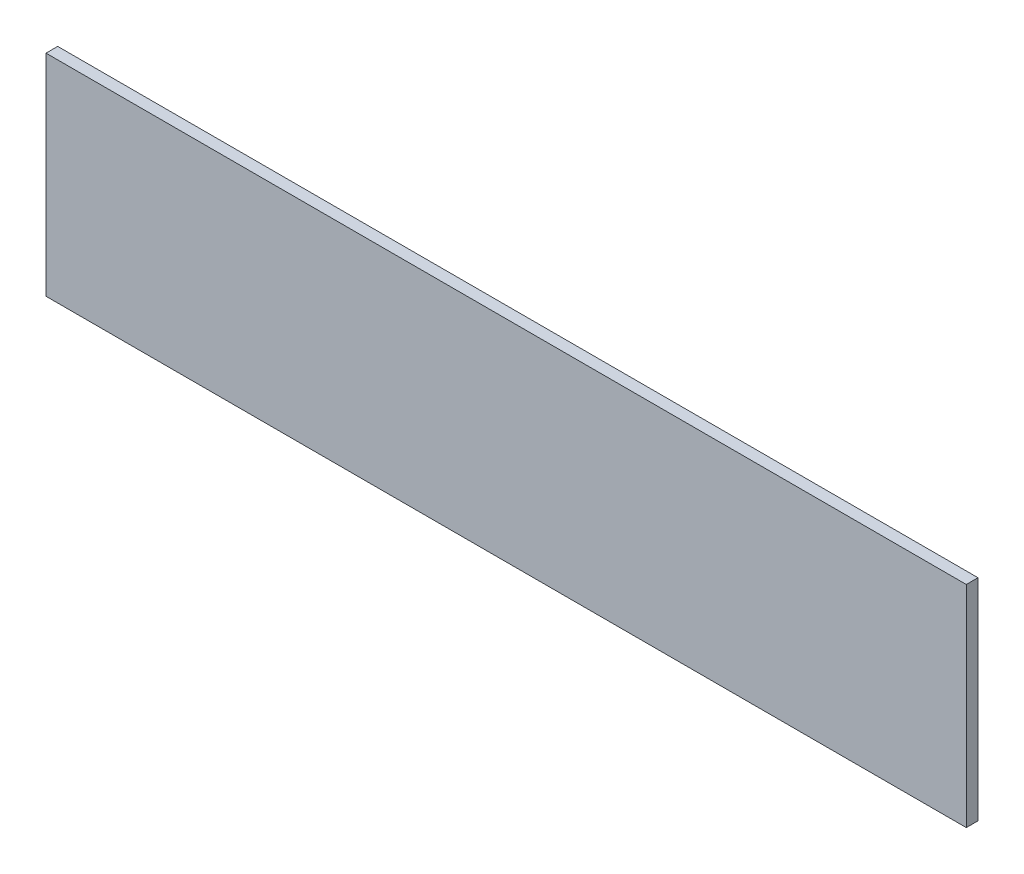
ISO-10303-21;
HEADER;
FILE_DESCRIPTION(('STEP AP214'),'2;1');
FILE_NAME('part.step','',(''),(''),'','','');
FILE_SCHEMA(('AUTOMOTIVE_DESIGN { 1 0 10303 214 1 1 1 1 }'));
ENDSEC;
DATA;
#1=APPLICATION_CONTEXT('core data for automotive mechanical design processes');
#2=APPLICATION_PROTOCOL_DEFINITION('international standard','automotive_design',2000,#1);
#3=PRODUCT_CONTEXT('',#1,'mechanical');
#4=PRODUCT('Part','Part','',(#3));
#5=PRODUCT_RELATED_PRODUCT_CATEGORY('part','',(#4));
#6=PRODUCT_DEFINITION_FORMATION('','',#4);
#7=PRODUCT_DEFINITION_CONTEXT('part definition',#1,'design');
#8=PRODUCT_DEFINITION('design','',#6,#7);
#9=PRODUCT_DEFINITION_SHAPE('','',#8);
#10=(LENGTH_UNIT() NAMED_UNIT(*) SI_UNIT(.MILLI.,.METRE.));
#11=(NAMED_UNIT(*) PLANE_ANGLE_UNIT() SI_UNIT($,.RADIAN.));
#12=(NAMED_UNIT(*) SI_UNIT($,.STERADIAN.) SOLID_ANGLE_UNIT());
#13=UNCERTAINTY_MEASURE_WITH_UNIT(LENGTH_MEASURE(1.E-05),#10,'distance_accuracy_value','');
#14=(GEOMETRIC_REPRESENTATION_CONTEXT(3) GLOBAL_UNCERTAINTY_ASSIGNED_CONTEXT((#13)) GLOBAL_UNIT_ASSIGNED_CONTEXT((#10,
#11,#12)) REPRESENTATION_CONTEXT('',''));
#15=CARTESIAN_POINT('',(0.,0.,0.));
#16=DIRECTION('',(0.,0.,1.));
#17=DIRECTION('',(1.,0.,0.));
#18=AXIS2_PLACEMENT_3D('',#15,#16,#17);
#19=CARTESIAN_POINT('',(-107.265805358834,-170.768597763726,0.761999999999719));
#20=DIRECTION('',(0.,-1.,0.));
#21=DIRECTION('',(0.,0.,-1.));
#22=AXIS2_PLACEMENT_3D('',#19,#20,#21);
#23=PLANE('',#22);
#24=DIRECTION('',(-1.,0.,0.));
#25=VECTOR('',#24,1.);
#26=CARTESIAN_POINT('',(-107.265805358834,-170.768597763726,-2.64111649217469E-13));
#27=LINE('',#26,#25);
#28=CARTESIAN_POINT('',(-107.265805358834,-170.768597763726,-2.64111649217469E-13));
#29=VERTEX_POINT('',#28);
#30=CARTESIAN_POINT('',(-167.209805358834,-170.768597763726,-2.14238349283136E-13));
#31=VERTEX_POINT('',#30);
#32=EDGE_CURVE('E95',#29,#31,#27,.T.);
#33=ORIENTED_EDGE('',*,*,#32,.T.);
#34=DIRECTION('',(0.,0.,-1.));
#35=VECTOR('',#34,1.);
#36=CARTESIAN_POINT('',(-167.209805358834,-170.768597763726,0.761999999999773));
#37=LINE('',#36,#35);
#38=CARTESIAN_POINT('',(-167.209805358834,-170.768597763726,0.761999999999773));
#39=VERTEX_POINT('',#38);
#40=EDGE_CURVE('E11',#39,#31,#37,.T.);
#41=ORIENTED_EDGE('',*,*,#40,.F.);
#42=DIRECTION('',(-1.,0.,0.));
#43=VECTOR('',#42,1.);
#44=CARTESIAN_POINT('',(-107.265805358834,-170.768597763726,0.761999999999719));
#45=LINE('',#44,#43);
#46=CARTESIAN_POINT('',(-107.265805358834,-170.768597763726,0.761999999999719));
#47=VERTEX_POINT('',#46);
#48=EDGE_CURVE('E83',#47,#39,#45,.T.);
#49=ORIENTED_EDGE('',*,*,#48,.F.);
#50=DIRECTION('',(0.,0.,-1.));
#51=VECTOR('',#50,1.);
#52=CARTESIAN_POINT('',(-107.265805358834,-170.768597763726,0.761999999999719));
#53=LINE('',#52,#51);
#54=EDGE_CURVE('E91',#47,#29,#53,.T.);
#55=ORIENTED_EDGE('',*,*,#54,.T.);
#56=EDGE_LOOP('',(#33,#41,#49,#55));
#57=FACE_BOUND('',#56,.T.);
#58=ADVANCED_FACE('F32',(#57),#23,.F.);
#59=CARTESIAN_POINT('',(-167.209805358834,-170.768597763726,0.761999999999773));
#60=DIRECTION('',(1.,0.,0.));
#61=DIRECTION('',(0.,0.,-1.));
#62=AXIS2_PLACEMENT_3D('',#59,#60,#61);
#63=PLANE('',#62);
#64=DIRECTION('',(0.,-1.,0.));
#65=VECTOR('',#64,1.);
#66=CARTESIAN_POINT('',(-167.209805358834,-170.768597763726,-2.14238349283136E-13));
#67=LINE('',#66,#65);
#68=CARTESIAN_POINT('',(-167.209805358834,-184.484597763727,-3.36970035208495E-13));
#69=VERTEX_POINT('',#68);
#70=EDGE_CURVE('E87',#31,#69,#67,.T.);
#71=ORIENTED_EDGE('',*,*,#70,.T.);
#72=DIRECTION('',(0.,0.,-1.));
#73=VECTOR('',#72,1.);
#74=CARTESIAN_POINT('',(-167.209805358834,-184.484597763727,0.761999999999648));
#75=LINE('',#74,#73);
#76=CARTESIAN_POINT('',(-167.209805358834,-184.484597763727,0.761999999999648));
#77=VERTEX_POINT('',#76);
#78=EDGE_CURVE('E40',#77,#69,#75,.T.);
#79=ORIENTED_EDGE('',*,*,#78,.F.);
#80=DIRECTION('',(0.,-1.,0.));
#81=VECTOR('',#80,1.);
#82=CARTESIAN_POINT('',(-167.209805358834,-170.768597763726,0.761999999999773));
#83=LINE('',#82,#81);
#84=EDGE_CURVE('E78',#39,#77,#83,.T.);
#85=ORIENTED_EDGE('',*,*,#84,.F.);
#86=ORIENTED_EDGE('',*,*,#40,.T.);
#87=EDGE_LOOP('',(#71,#79,#85,#86));
#88=FACE_BOUND('',#87,.T.);
#89=ADVANCED_FACE('F86',(#88),#63,.F.);
#90=CARTESIAN_POINT('',(-167.209805358834,-184.484597763727,0.761999999999648));
#91=DIRECTION('',(0.,1.,0.));
#92=DIRECTION('',(0.,0.,1.));
#93=AXIS2_PLACEMENT_3D('',#90,#91,#92);
#94=PLANE('',#93);
#95=DIRECTION('',(1.,0.,0.));
#96=VECTOR('',#95,1.);
#97=CARTESIAN_POINT('',(-167.209805358834,-184.484597763727,-3.36970035208495E-13));
#98=LINE('',#97,#96);
#99=CARTESIAN_POINT('',(-107.265805358834,-184.484597763727,-1.4137996329211E-13));
#100=VERTEX_POINT('',#99);
#101=EDGE_CURVE('E65',#69,#100,#98,.T.);
#102=ORIENTED_EDGE('',*,*,#101,.T.);
#103=DIRECTION('',(0.,0.,-1.));
#104=VECTOR('',#103,1.);
#105=CARTESIAN_POINT('',(-107.265805358834,-184.484597763727,0.761999999999844));
#106=LINE('',#105,#104);
#107=CARTESIAN_POINT('',(-107.265805358834,-184.484597763727,0.761999999999844));
#108=VERTEX_POINT('',#107);
#109=EDGE_CURVE('E88',#108,#100,#106,.T.);
#110=ORIENTED_EDGE('',*,*,#109,.F.);
#111=DIRECTION('',(1.,0.,0.));
#112=VECTOR('',#111,1.);
#113=CARTESIAN_POINT('',(-167.209805358834,-184.484597763727,0.761999999999648));
#114=LINE('',#113,#112);
#115=EDGE_CURVE('E81',#77,#108,#114,.T.);
#116=ORIENTED_EDGE('',*,*,#115,.F.);
#117=ORIENTED_EDGE('',*,*,#78,.T.);
#118=EDGE_LOOP('',(#102,#110,#116,#117));
#119=FACE_BOUND('',#118,.T.);
#120=ADVANCED_FACE('F89',(#119),#94,.F.);
#121=CARTESIAN_POINT('',(-107.265805358834,-184.484597763727,0.761999999999844));
#122=DIRECTION('',(-1.,0.,0.));
#123=DIRECTION('',(0.,0.,1.));
#124=AXIS2_PLACEMENT_3D('',#121,#122,#123);
#125=PLANE('',#124);
#126=DIRECTION('',(0.,1.,0.));
#127=VECTOR('',#126,1.);
#128=CARTESIAN_POINT('',(-107.265805358834,-184.484597763727,-1.4137996329211E-13));
#129=LINE('',#128,#127);
#130=EDGE_CURVE('E71',#100,#29,#129,.T.);
#131=ORIENTED_EDGE('',*,*,#130,.T.);
#132=ORIENTED_EDGE('',*,*,#54,.F.);
#133=DIRECTION('',(0.,1.,0.));
#134=VECTOR('',#133,1.);
#135=CARTESIAN_POINT('',(-107.265805358834,-184.484597763727,0.761999999999844));
#136=LINE('',#135,#134);
#137=EDGE_CURVE('E48',#108,#47,#136,.T.);
#138=ORIENTED_EDGE('',*,*,#137,.F.);
#139=ORIENTED_EDGE('',*,*,#109,.T.);
#140=EDGE_LOOP('',(#131,#132,#138,#139));
#141=FACE_BOUND('',#140,.T.);
#142=ADVANCED_FACE('F102',(#141),#125,.F.);
#143=CARTESIAN_POINT('',(0.,0.,0.761999999999985));
#144=DIRECTION('',(0.,0.,1.));
#145=DIRECTION('',(1.,0.,0.));
#146=AXIS2_PLACEMENT_3D('',#143,#144,#145);
#147=PLANE('',#146);
#148=ORIENTED_EDGE('',*,*,#48,.T.);
#149=ORIENTED_EDGE('',*,*,#84,.T.);
#150=ORIENTED_EDGE('',*,*,#115,.T.);
#151=ORIENTED_EDGE('',*,*,#137,.T.);
#152=EDGE_LOOP('',(#148,#149,#150,#151));
#153=FACE_BOUND('',#152,.T.);
#154=ADVANCED_FACE('F79',(#153),#147,.T.);
#155=CARTESIAN_POINT('',(0.,0.,0.));
#156=DIRECTION('',(0.,0.,1.));
#157=DIRECTION('',(1.,0.,0.));
#158=AXIS2_PLACEMENT_3D('',#155,#156,#157);
#159=PLANE('',#158);
#160=ORIENTED_EDGE('',*,*,#32,.F.);
#161=ORIENTED_EDGE('',*,*,#130,.F.);
#162=ORIENTED_EDGE('',*,*,#101,.F.);
#163=ORIENTED_EDGE('',*,*,#70,.F.);
#164=EDGE_LOOP('',(#160,#161,#162,#163));
#165=FACE_BOUND('',#164,.T.);
#166=ADVANCED_FACE('F105',(#165),#159,.F.);
#167=CLOSED_SHELL('',(#58,#89,#120,#142,#154,#166));
#168=MANIFOLD_SOLID_BREP('B2',#167);
#169=ADVANCED_BREP_SHAPE_REPRESENTATION('',(#18,#168),#14);
#170=SHAPE_DEFINITION_REPRESENTATION(#9,#169);
ENDSEC;
END-ISO-10303-21;
